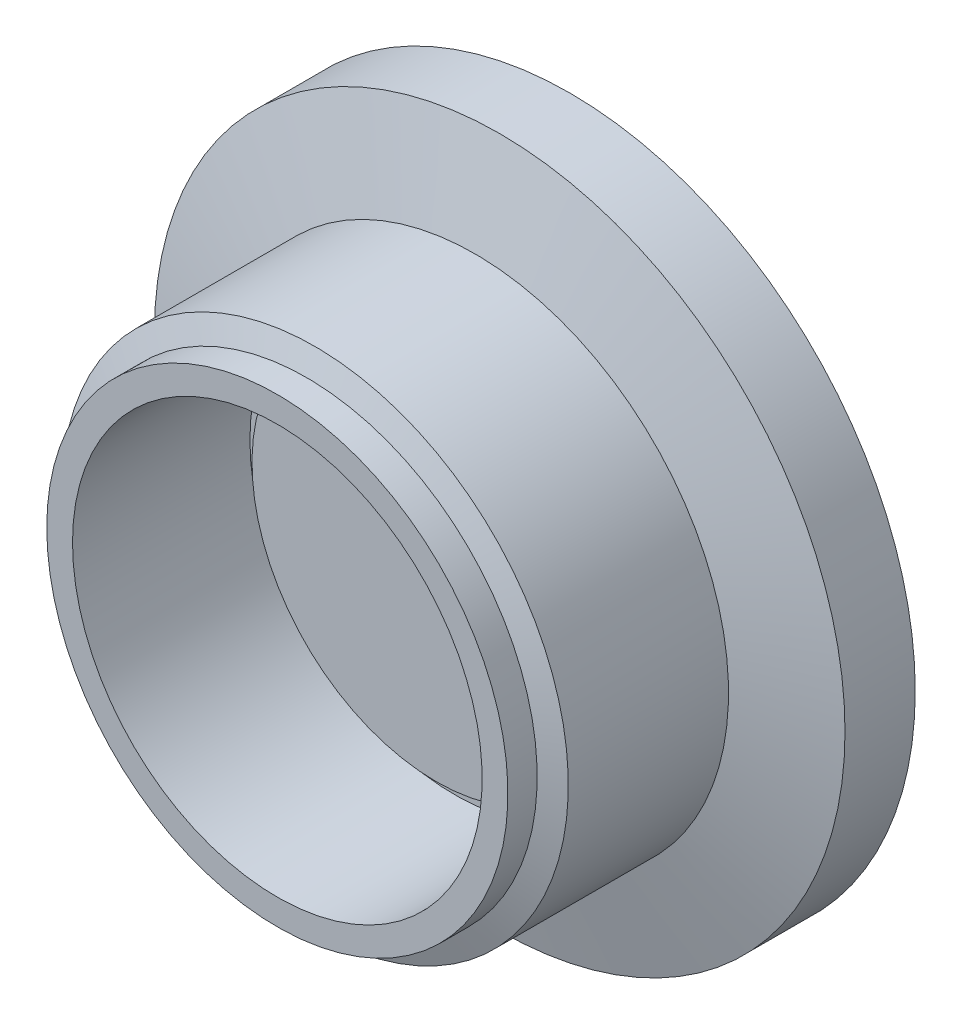
ISO-10303-21;
HEADER;
FILE_DESCRIPTION(('STEP AP214'),'2;1');
FILE_NAME('part.step','',(''),(''),'','','');
FILE_SCHEMA(('AUTOMOTIVE_DESIGN { 1 0 10303 214 1 1 1 1 }'));
ENDSEC;
DATA;
#1=APPLICATION_CONTEXT('core data for automotive mechanical design processes');
#2=APPLICATION_PROTOCOL_DEFINITION('international standard','automotive_design',2000,#1);
#3=PRODUCT_CONTEXT('',#1,'mechanical');
#4=PRODUCT('Part','Part','',(#3));
#5=PRODUCT_RELATED_PRODUCT_CATEGORY('part','',(#4));
#6=PRODUCT_DEFINITION_FORMATION('','',#4);
#7=PRODUCT_DEFINITION_CONTEXT('part definition',#1,'design');
#8=PRODUCT_DEFINITION('design','',#6,#7);
#9=PRODUCT_DEFINITION_SHAPE('','',#8);
#10=(LENGTH_UNIT() NAMED_UNIT(*) SI_UNIT(.MILLI.,.METRE.));
#11=(NAMED_UNIT(*) PLANE_ANGLE_UNIT() SI_UNIT($,.RADIAN.));
#12=(NAMED_UNIT(*) SI_UNIT($,.STERADIAN.) SOLID_ANGLE_UNIT());
#13=UNCERTAINTY_MEASURE_WITH_UNIT(LENGTH_MEASURE(1.E-05),#10,'distance_accuracy_value','');
#14=(GEOMETRIC_REPRESENTATION_CONTEXT(3) GLOBAL_UNCERTAINTY_ASSIGNED_CONTEXT((#13)) GLOBAL_UNIT_ASSIGNED_CONTEXT((#10,
#11,#12)) REPRESENTATION_CONTEXT('',''));
#15=CARTESIAN_POINT('',(0.,0.,0.));
#16=DIRECTION('',(0.,0.,1.));
#17=DIRECTION('',(1.,0.,0.));
#18=AXIS2_PLACEMENT_3D('',#15,#16,#17);
#19=CARTESIAN_POINT('',(0.,0.,54.00675));
#20=DIRECTION('',(0.,0.,1.));
#21=DIRECTION('',(-1.,0.,0.));
#22=AXIS2_PLACEMENT_3D('',#19,#20,#21);
#23=CYLINDRICAL_SURFACE('',#22,8.89);
#24=CARTESIAN_POINT('',(0.,0.,0.));
#25=DIRECTION('',(0.,0.,-1.));
#26=DIRECTION('',(-1.,0.,0.));
#27=AXIS2_PLACEMENT_3D('',#24,#25,#26);
#28=CIRCLE('',#27,8.89);
#29=CARTESIAN_POINT('',(-8.89,0.,0.));
#30=VERTEX_POINT('',#29);
#31=EDGE_CURVE('E30',#30,#30,#28,.T.);
#32=ORIENTED_EDGE('',*,*,#31,.F.);
#33=EDGE_LOOP('',(#32));
#34=FACE_BOUND('',#33,.T.);
#35=CARTESIAN_POINT('',(0.,0.,-7.7));
#36=DIRECTION('',(0.,0.,-1.));
#37=DIRECTION('',(-1.,0.,0.));
#38=AXIS2_PLACEMENT_3D('',#35,#36,#37);
#39=CIRCLE('',#38,8.89);
#40=CARTESIAN_POINT('',(-8.89,0.,-7.7));
#41=VERTEX_POINT('',#40);
#42=EDGE_CURVE('E10',#41,#41,#39,.T.);
#43=ORIENTED_EDGE('',*,*,#42,.T.);
#44=EDGE_LOOP('',(#43));
#45=FACE_BOUND('',#44,.T.);
#46=ADVANCED_FACE('F14',(#34,#45),#23,.F.);
#47=CARTESIAN_POINT('',(0.,0.,-6.9));
#48=DIRECTION('',(0.,0.,1.));
#49=DIRECTION('',(-1.,0.,0.));
#50=AXIS2_PLACEMENT_3D('',#47,#48,#49);
#51=PLANE('',#50);
#52=CARTESIAN_POINT('',(0.,0.,-6.9));
#53=DIRECTION('',(0.,0.,1.));
#54=DIRECTION('',(0.,-1.,0.));
#55=AXIS2_PLACEMENT_3D('',#52,#53,#54);
#56=CIRCLE('',#55,8.);
#57=CARTESIAN_POINT('',(0.,-8.,-6.9));
#58=VERTEX_POINT('',#57);
#59=EDGE_CURVE('E22',#58,#58,#56,.T.);
#60=ORIENTED_EDGE('',*,*,#59,.T.);
#61=EDGE_LOOP('',(#60));
#62=FACE_BOUND('',#61,.T.);
#63=ADVANCED_FACE('F78',(#62),#51,.T.);
#64=CARTESIAN_POINT('',(0.,0.,-6.9));
#65=DIRECTION('',(0.,0.,1.));
#66=DIRECTION('',(1.,0.,0.));
#67=AXIS2_PLACEMENT_3D('',#64,#65,#66);
#68=CYLINDRICAL_SURFACE('',#67,8.);
#69=ORIENTED_EDGE('',*,*,#59,.F.);
#70=EDGE_LOOP('',(#69));
#71=FACE_BOUND('',#70,.T.);
#72=CARTESIAN_POINT('',(0.,0.,-7.7));
#73=DIRECTION('',(0.,0.,1.));
#74=DIRECTION('',(-1.,0.,0.));
#75=AXIS2_PLACEMENT_3D('',#72,#73,#74);
#76=CIRCLE('',#75,8.);
#77=CARTESIAN_POINT('',(-8.,0.,-7.7));
#78=VERTEX_POINT('',#77);
#79=EDGE_CURVE('E27',#78,#78,#76,.T.);
#80=ORIENTED_EDGE('',*,*,#79,.T.);
#81=EDGE_LOOP('',(#80));
#82=FACE_BOUND('',#81,.T.);
#83=ADVANCED_FACE('F84',(#71,#82),#68,.T.);
#84=CARTESIAN_POINT('',(-8.,0.,-7.7));
#85=DIRECTION('',(0.,0.,-1.));
#86=DIRECTION('',(-1.,0.,0.));
#87=AXIS2_PLACEMENT_3D('',#84,#85,#86);
#88=PLANE('',#87);
#89=ORIENTED_EDGE('',*,*,#42,.F.);
#90=EDGE_LOOP('',(#89));
#91=FACE_BOUND('',#90,.T.);
#92=ORIENTED_EDGE('',*,*,#79,.F.);
#93=EDGE_LOOP('',(#92));
#94=FACE_BOUND('',#93,.T.);
#95=ADVANCED_FACE('F91',(#91,#94),#88,.F.);
#96=CARTESIAN_POINT('',(-8.89,0.,-8.5));
#97=DIRECTION('',(0.,0.,1.));
#98=DIRECTION('',(1.,0.,0.));
#99=AXIS2_PLACEMENT_3D('',#96,#97,#98);
#100=PLANE('',#99);
#101=CARTESIAN_POINT('',(0.,0.,-8.5));
#102=DIRECTION('',(0.,0.,-1.));
#103=DIRECTION('',(-1.,0.,0.));
#104=AXIS2_PLACEMENT_3D('',#101,#102,#103);
#105=CIRCLE('',#104,8.89);
#106=CARTESIAN_POINT('',(-8.89,0.,-8.5));
#107=VERTEX_POINT('',#106);
#108=EDGE_CURVE('E34',#107,#107,#105,.T.);
#109=ORIENTED_EDGE('',*,*,#108,.T.);
#110=EDGE_LOOP('',(#109));
#111=FACE_BOUND('',#110,.T.);
#112=ADVANCED_FACE('F95',(#111),#100,.F.);
#113=CARTESIAN_POINT('',(0.,0.,54.00675));
#114=DIRECTION('',(0.,0.,1.));
#115=DIRECTION('',(-1.,0.,0.));
#116=AXIS2_PLACEMENT_3D('',#113,#114,#115);
#117=CYLINDRICAL_SURFACE('',#116,8.89);
#118=ORIENTED_EDGE('',*,*,#108,.F.);
#119=EDGE_LOOP('',(#118));
#120=FACE_BOUND('',#119,.T.);
#121=CARTESIAN_POINT('',(0.,0.,-10.033));
#122=DIRECTION('',(0.,0.,-1.));
#123=DIRECTION('',(-1.,0.,0.));
#124=AXIS2_PLACEMENT_3D('',#121,#122,#123);
#125=CIRCLE('',#124,8.89);
#126=CARTESIAN_POINT('',(-8.89,0.,-10.033));
#127=VERTEX_POINT('',#126);
#128=EDGE_CURVE('E37',#127,#127,#125,.T.);
#129=ORIENTED_EDGE('',*,*,#128,.T.);
#130=EDGE_LOOP('',(#129));
#131=FACE_BOUND('',#130,.T.);
#132=ADVANCED_FACE('F99',(#120,#131),#117,.F.);
#133=CARTESIAN_POINT('',(-8.89,0.,0.));
#134=DIRECTION('',(0.,0.,-1.));
#135=DIRECTION('',(-1.,0.,0.));
#136=AXIS2_PLACEMENT_3D('',#133,#134,#135);
#137=PLANE('',#136);
#138=CARTESIAN_POINT('',(0.,0.,0.));
#139=DIRECTION('',(0.,0.,-1.));
#140=DIRECTION('',(-1.,0.,0.));
#141=AXIS2_PLACEMENT_3D('',#138,#139,#140);
#142=CIRCLE('',#141,10.0076);
#143=CARTESIAN_POINT('',(-10.0076,0.,0.));
#144=VERTEX_POINT('',#143);
#145=EDGE_CURVE('E40',#144,#144,#142,.T.);
#146=ORIENTED_EDGE('',*,*,#145,.F.);
#147=EDGE_LOOP('',(#146));
#148=FACE_BOUND('',#147,.T.);
#149=ORIENTED_EDGE('',*,*,#31,.T.);
#150=EDGE_LOOP('',(#149));
#151=FACE_BOUND('',#150,.T.);
#152=ADVANCED_FACE('F103',(#148,#151),#137,.F.);
#153=CARTESIAN_POINT('',(0.,0.,54.00675));
#154=DIRECTION('',(0.,0.,1.));
#155=DIRECTION('',(-1.,0.,0.));
#156=AXIS2_PLACEMENT_3D('',#153,#154,#155);
#157=CYLINDRICAL_SURFACE('',#156,10.0076);
#158=CARTESIAN_POINT('',(0.,0.,-1.27));
#159=DIRECTION('',(0.,0.,-1.));
#160=DIRECTION('',(-1.,0.,0.));
#161=AXIS2_PLACEMENT_3D('',#158,#159,#160);
#162=CIRCLE('',#161,10.0076);
#163=CARTESIAN_POINT('',(-10.0076,0.,-1.27));
#164=VERTEX_POINT('',#163);
#165=EDGE_CURVE('E43',#164,#164,#162,.T.);
#166=ORIENTED_EDGE('',*,*,#165,.F.);
#167=EDGE_LOOP('',(#166));
#168=FACE_BOUND('',#167,.T.);
#169=ORIENTED_EDGE('',*,*,#145,.T.);
#170=EDGE_LOOP('',(#169));
#171=FACE_BOUND('',#170,.T.);
#172=ADVANCED_FACE('F107',(#168,#171),#157,.T.);
#173=CARTESIAN_POINT('',(0.,0.,-1.27));
#174=DIRECTION('',(0.,0.,-1.));
#175=DIRECTION('',(-1.,0.,0.));
#176=AXIS2_PLACEMENT_3D('',#173,#174,#175);
#177=CONICAL_SURFACE('',#176,10.0076,1.22173047639603);
#178=CARTESIAN_POINT('',(0.,0.,-1.6305489140641));
#179=DIRECTION('',(0.,0.,-1.));
#180=DIRECTION('',(-1.,0.,0.));
#181=AXIS2_PLACEMENT_3D('',#178,#179,#180);
#182=CIRCLE('',#181,10.9982);
#183=CARTESIAN_POINT('',(-10.9982,0.,-1.6305489140641));
#184=VERTEX_POINT('',#183);
#185=EDGE_CURVE('E46',#184,#184,#182,.T.);
#186=ORIENTED_EDGE('',*,*,#185,.F.);
#187=EDGE_LOOP('',(#186));
#188=FACE_BOUND('',#187,.T.);
#189=ORIENTED_EDGE('',*,*,#165,.T.);
#190=EDGE_LOOP('',(#189));
#191=FACE_BOUND('',#190,.T.);
#192=ADVANCED_FACE('F111',(#188,#191),#177,.T.);
#193=CARTESIAN_POINT('',(0.,0.,54.00675));
#194=DIRECTION('',(0.,0.,1.));
#195=DIRECTION('',(-1.,0.,0.));
#196=AXIS2_PLACEMENT_3D('',#193,#194,#195);
#197=CYLINDRICAL_SURFACE('',#196,10.9982);
#198=CARTESIAN_POINT('',(0.,0.,-8.58347221042316));
#199=DIRECTION('',(0.,0.,-1.));
#200=DIRECTION('',(-1.,0.,0.));
#201=AXIS2_PLACEMENT_3D('',#198,#199,#200);
#202=CIRCLE('',#201,10.9982);
#203=CARTESIAN_POINT('',(-10.9982,0.,-8.58347221042316));
#204=VERTEX_POINT('',#203);
#205=EDGE_CURVE('E49',#204,#204,#202,.T.);
#206=ORIENTED_EDGE('',*,*,#205,.F.);
#207=EDGE_LOOP('',(#206));
#208=FACE_BOUND('',#207,.T.);
#209=ORIENTED_EDGE('',*,*,#185,.T.);
#210=EDGE_LOOP('',(#209));
#211=FACE_BOUND('',#210,.T.);
#212=ADVANCED_FACE('F115',(#208,#211),#197,.T.);
#213=CARTESIAN_POINT('',(0.,0.,-8.58347221042316));
#214=DIRECTION('',(0.,0.,-1.));
#215=DIRECTION('',(-1.,0.,0.));
#216=AXIS2_PLACEMENT_3D('',#213,#214,#215);
#217=CONICAL_SURFACE('',#216,10.9982,1.30899693899575);
#218=CARTESIAN_POINT('',(0.,0.,-9.652));
#219=DIRECTION('',(0.,0.,-1.));
#220=DIRECTION('',(-1.,0.,0.));
#221=AXIS2_PLACEMENT_3D('',#218,#219,#220);
#222=CIRCLE('',#221,14.986);
#223=CARTESIAN_POINT('',(-14.986,0.,-9.652));
#224=VERTEX_POINT('',#223);
#225=EDGE_CURVE('E52',#224,#224,#222,.T.);
#226=ORIENTED_EDGE('',*,*,#225,.F.);
#227=EDGE_LOOP('',(#226));
#228=FACE_BOUND('',#227,.T.);
#229=ORIENTED_EDGE('',*,*,#205,.T.);
#230=EDGE_LOOP('',(#229));
#231=FACE_BOUND('',#230,.T.);
#232=ADVANCED_FACE('F119',(#228,#231),#217,.T.);
#233=CARTESIAN_POINT('',(0.,0.,54.00675));
#234=DIRECTION('',(0.,0.,1.));
#235=DIRECTION('',(-1.,0.,0.));
#236=AXIS2_PLACEMENT_3D('',#233,#234,#235);
#237=CYLINDRICAL_SURFACE('',#236,14.986);
#238=CARTESIAN_POINT('',(0.,0.,-12.7));
#239=DIRECTION('',(0.,0.,-1.));
#240=DIRECTION('',(-1.,0.,0.));
#241=AXIS2_PLACEMENT_3D('',#238,#239,#240);
#242=CIRCLE('',#241,14.986);
#243=CARTESIAN_POINT('',(-14.986,0.,-12.7));
#244=VERTEX_POINT('',#243);
#245=EDGE_CURVE('E55',#244,#244,#242,.T.);
#246=ORIENTED_EDGE('',*,*,#245,.F.);
#247=EDGE_LOOP('',(#246));
#248=FACE_BOUND('',#247,.T.);
#249=ORIENTED_EDGE('',*,*,#225,.T.);
#250=EDGE_LOOP('',(#249));
#251=FACE_BOUND('',#250,.T.);
#252=ADVANCED_FACE('F74',(#248,#251),#237,.T.);
#253=CARTESIAN_POINT('',(-14.986,0.,-12.7));
#254=DIRECTION('',(0.,0.,1.));
#255=DIRECTION('',(1.,0.,0.));
#256=AXIS2_PLACEMENT_3D('',#253,#254,#255);
#257=PLANE('',#256);
#258=CARTESIAN_POINT('',(0.,0.,-12.7));
#259=DIRECTION('',(0.,0.,-1.));
#260=DIRECTION('',(-1.,0.,0.));
#261=AXIS2_PLACEMENT_3D('',#258,#259,#260);
#262=CIRCLE('',#261,8.5852);
#263=CARTESIAN_POINT('',(-8.5852,0.,-12.7));
#264=VERTEX_POINT('',#263);
#265=EDGE_CURVE('E57',#264,#264,#262,.T.);
#266=ORIENTED_EDGE('',*,*,#265,.F.);
#267=EDGE_LOOP('',(#266));
#268=FACE_BOUND('',#267,.T.);
#269=ORIENTED_EDGE('',*,*,#245,.T.);
#270=EDGE_LOOP('',(#269));
#271=FACE_BOUND('',#270,.T.);
#272=ADVANCED_FACE('F67',(#268,#271),#257,.F.);
#273=CARTESIAN_POINT('',(0.,0.,54.00675));
#274=DIRECTION('',(0.,0.,1.));
#275=DIRECTION('',(-1.,0.,0.));
#276=AXIS2_PLACEMENT_3D('',#273,#274,#275);
#277=CYLINDRICAL_SURFACE('',#276,8.5852);
#278=CARTESIAN_POINT('',(0.,0.,-10.033));
#279=DIRECTION('',(0.,0.,-1.));
#280=DIRECTION('',(-1.,0.,0.));
#281=AXIS2_PLACEMENT_3D('',#278,#279,#280);
#282=CIRCLE('',#281,8.5852);
#283=CARTESIAN_POINT('',(-8.5852,0.,-10.033));
#284=VERTEX_POINT('',#283);
#285=EDGE_CURVE('E18',#284,#284,#282,.T.);
#286=ORIENTED_EDGE('',*,*,#285,.F.);
#287=EDGE_LOOP('',(#286));
#288=FACE_BOUND('',#287,.T.);
#289=ORIENTED_EDGE('',*,*,#265,.T.);
#290=EDGE_LOOP('',(#289));
#291=FACE_BOUND('',#290,.T.);
#292=ADVANCED_FACE('F65',(#288,#291),#277,.F.);
#293=CARTESIAN_POINT('',(-8.5852,0.,-10.033));
#294=DIRECTION('',(0.,0.,-1.));
#295=DIRECTION('',(-1.,0.,0.));
#296=AXIS2_PLACEMENT_3D('',#293,#294,#295);
#297=PLANE('',#296);
#298=ORIENTED_EDGE('',*,*,#128,.F.);
#299=EDGE_LOOP('',(#298));
#300=FACE_BOUND('',#299,.T.);
#301=ORIENTED_EDGE('',*,*,#285,.T.);
#302=EDGE_LOOP('',(#301));
#303=FACE_BOUND('',#302,.T.);
#304=ADVANCED_FACE('F16',(#300,#303),#297,.F.);
#305=CLOSED_SHELL('',(#46,#63,#83,#95,#112,#132,#152,#172,#192,#212,#232,#252,#272,#292,#304));
#306=MANIFOLD_SOLID_BREP('B1',#305);
#307=ADVANCED_BREP_SHAPE_REPRESENTATION('',(#18,#306),#14);
#308=SHAPE_DEFINITION_REPRESENTATION(#9,#307);
ENDSEC;
END-ISO-10303-21;
